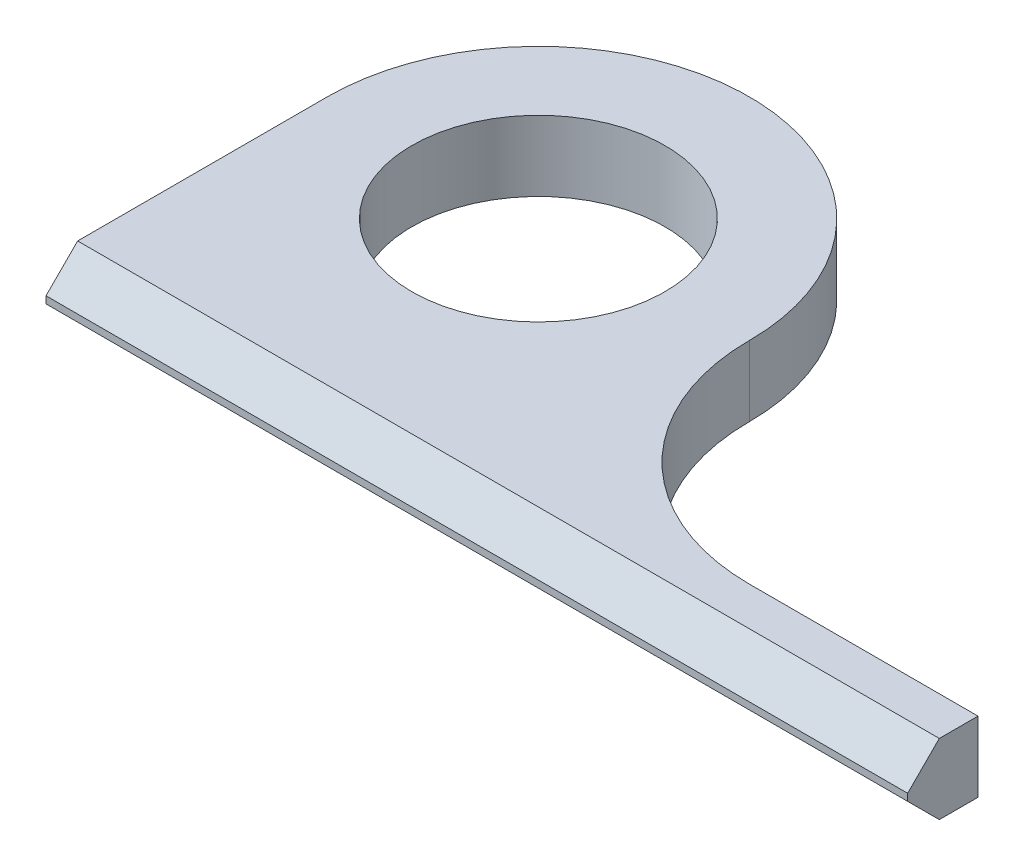
ISO-10303-21;
HEADER;
FILE_DESCRIPTION(('STEP AP214'),'2;1');
FILE_NAME('part.step','',(''),(''),'','','');
FILE_SCHEMA(('AUTOMOTIVE_DESIGN { 1 0 10303 214 1 1 1 1 }'));
ENDSEC;
DATA;
#1=APPLICATION_CONTEXT('core data for automotive mechanical design processes');
#2=APPLICATION_PROTOCOL_DEFINITION('international standard','automotive_design',2000,#1);
#3=PRODUCT_CONTEXT('',#1,'mechanical');
#4=PRODUCT('Part','Part','',(#3));
#5=PRODUCT_RELATED_PRODUCT_CATEGORY('part','',(#4));
#6=PRODUCT_DEFINITION_FORMATION('','',#4);
#7=PRODUCT_DEFINITION_CONTEXT('part definition',#1,'design');
#8=PRODUCT_DEFINITION('design','',#6,#7);
#9=PRODUCT_DEFINITION_SHAPE('','',#8);
#10=(LENGTH_UNIT() NAMED_UNIT(*) SI_UNIT(.MILLI.,.METRE.));
#11=(NAMED_UNIT(*) PLANE_ANGLE_UNIT() SI_UNIT($,.RADIAN.));
#12=(NAMED_UNIT(*) SI_UNIT($,.STERADIAN.) SOLID_ANGLE_UNIT());
#13=UNCERTAINTY_MEASURE_WITH_UNIT(LENGTH_MEASURE(1.E-05),#10,'distance_accuracy_value','');
#14=(GEOMETRIC_REPRESENTATION_CONTEXT(3) GLOBAL_UNCERTAINTY_ASSIGNED_CONTEXT((#13)) GLOBAL_UNIT_ASSIGNED_CONTEXT((#10,
#11,#12)) REPRESENTATION_CONTEXT('',''));
#15=CARTESIAN_POINT('',(0.,0.,0.));
#16=DIRECTION('',(0.,0.,1.));
#17=DIRECTION('',(1.,0.,0.));
#18=AXIS2_PLACEMENT_3D('',#15,#16,#17);
#19=CARTESIAN_POINT('',(62.5,4.5,75.5));
#20=DIRECTION('',(0.,-0.707106781186548,0.707106781186548));
#21=DIRECTION('',(0.,-0.707106781186548,-0.707106781186548));
#22=AXIS2_PLACEMENT_3D('',#19,#20,#21);
#23=PLANE('',#22);
#24=DIRECTION('',(1.,0.,0.));
#25=VECTOR('',#24,1.);
#26=CARTESIAN_POINT('',(-60.0000000000001,9.00000000000001,80.));
#27=LINE('',#26,#25);
#28=CARTESIAN_POINT('',(-60.0000000000001,9.00000000000001,80.));
#29=VERTEX_POINT('',#28);
#30=CARTESIAN_POINT('',(185.,9.00000000000001,80.));
#31=VERTEX_POINT('',#30);
#32=EDGE_CURVE('E144',#29,#31,#27,.T.);
#33=ORIENTED_EDGE('',*,*,#32,.F.);
#34=DIRECTION('',(0.,0.707106781186548,0.707106781186547));
#35=VECTOR('',#34,1.);
#36=CARTESIAN_POINT('',(-60.0000000000001,0.,71.));
#37=LINE('',#36,#35);
#38=CARTESIAN_POINT('',(-60.0000000000001,0.,71.));
#39=VERTEX_POINT('',#38);
#40=EDGE_CURVE('E141',#39,#29,#37,.T.);
#41=ORIENTED_EDGE('',*,*,#40,.F.);
#42=DIRECTION('',(1.,0.,0.));
#43=VECTOR('',#42,1.);
#44=CARTESIAN_POINT('',(0.,0.,71.));
#45=LINE('',#44,#43);
#46=CARTESIAN_POINT('',(185.,0.,71.));
#47=VERTEX_POINT('',#46);
#48=EDGE_CURVE('E132',#39,#47,#45,.T.);
#49=ORIENTED_EDGE('',*,*,#48,.T.);
#50=DIRECTION('',(0.,-0.707106781186548,-0.707106781186547));
#51=VECTOR('',#50,1.);
#52=CARTESIAN_POINT('',(185.,9.00000000000001,80.));
#53=LINE('',#52,#51);
#54=EDGE_CURVE('E131',#31,#47,#53,.T.);
#55=ORIENTED_EDGE('',*,*,#54,.F.);
#56=EDGE_LOOP('',(#33,#41,#49,#55));
#57=FACE_BOUND('',#56,.T.);
#58=ADVANCED_FACE('F23',(#57),#23,.T.);
#59=CARTESIAN_POINT('',(-60.0000000000001,0.,80.));
#60=DIRECTION('',(0.,0.,1.));
#61=DIRECTION('',(1.,0.,0.));
#62=AXIS2_PLACEMENT_3D('',#59,#60,#61);
#63=PLANE('',#62);
#64=DIRECTION('',(0.,1.,0.));
#65=VECTOR('',#64,1.);
#66=CARTESIAN_POINT('',(185.,0.,80.));
#67=LINE('',#66,#65);
#68=CARTESIAN_POINT('',(185.,11.,80.));
#69=VERTEX_POINT('',#68);
#70=EDGE_CURVE('E128',#69,#31,#67,.F.);
#71=ORIENTED_EDGE('',*,*,#70,.F.);
#72=DIRECTION('',(1.,0.,0.));
#73=VECTOR('',#72,1.);
#74=CARTESIAN_POINT('',(62.5,11.,80.));
#75=LINE('',#74,#73);
#76=CARTESIAN_POINT('',(-60.0000000000001,11.,80.));
#77=VERTEX_POINT('',#76);
#78=EDGE_CURVE('E125',#77,#69,#75,.T.);
#79=ORIENTED_EDGE('',*,*,#78,.F.);
#80=DIRECTION('',(0.,1.,0.));
#81=VECTOR('',#80,1.);
#82=CARTESIAN_POINT('',(-60.0000000000001,0.,80.));
#83=LINE('',#82,#81);
#84=EDGE_CURVE('E139',#29,#77,#83,.T.);
#85=ORIENTED_EDGE('',*,*,#84,.F.);
#86=ORIENTED_EDGE('',*,*,#32,.T.);
#87=EDGE_LOOP('',(#71,#79,#85,#86));
#88=FACE_BOUND('',#87,.T.);
#89=ADVANCED_FACE('F231',(#88),#63,.T.);
#90=CARTESIAN_POINT('',(0.,0.,0.));
#91=DIRECTION('',(0.,1.,0.));
#92=DIRECTION('',(0.,0.,1.));
#93=AXIS2_PLACEMENT_3D('',#90,#91,#92);
#94=PLANE('',#93);
#95=CARTESIAN_POINT('',(0.,0.,0.));
#96=DIRECTION('',(0.,1.,0.));
#97=DIRECTION('',(0.,0.,1.));
#98=AXIS2_PLACEMENT_3D('',#95,#96,#97);
#99=CIRCLE('',#98,36.);
#100=CARTESIAN_POINT('',(0.,0.,36.));
#101=VERTEX_POINT('',#100);
#102=EDGE_CURVE('E119',#101,#101,#99,.T.);
#103=ORIENTED_EDGE('',*,*,#102,.T.);
#104=EDGE_LOOP('',(#103));
#105=FACE_BOUND('',#104,.T.);
#106=CARTESIAN_POINT('',(0.,0.,0.));
#107=DIRECTION('',(0.,1.,0.));
#108=DIRECTION('',(0.,0.,1.));
#109=AXIS2_PLACEMENT_3D('',#106,#107,#108);
#110=CIRCLE('',#109,60.);
#111=CARTESIAN_POINT('',(60.,0.,0.));
#112=VERTEX_POINT('',#111);
#113=CARTESIAN_POINT('',(-60.0000000000001,0.,0.));
#114=VERTEX_POINT('',#113);
#115=EDGE_CURVE('E93',#112,#114,#110,.T.);
#116=ORIENTED_EDGE('',*,*,#115,.F.);
#117=CARTESIAN_POINT('',(120.,0.,0.));
#118=DIRECTION('',(0.,1.,0.));
#119=DIRECTION('',(0.,0.,1.));
#120=AXIS2_PLACEMENT_3D('',#117,#118,#119);
#121=CIRCLE('',#120,60.);
#122=CARTESIAN_POINT('',(120.,0.,60.));
#123=VERTEX_POINT('',#122);
#124=EDGE_CURVE('E26',#112,#123,#121,.T.);
#125=ORIENTED_EDGE('',*,*,#124,.T.);
#126=DIRECTION('',(-1.,0.,0.));
#127=VECTOR('',#126,1.);
#128=CARTESIAN_POINT('',(185.,0.,60.));
#129=LINE('',#128,#127);
#130=CARTESIAN_POINT('',(185.,0.,60.));
#131=VERTEX_POINT('',#130);
#132=EDGE_CURVE('E90',#131,#123,#129,.T.);
#133=ORIENTED_EDGE('',*,*,#132,.F.);
#134=DIRECTION('',(0.,0.,-1.));
#135=VECTOR('',#134,1.);
#136=CARTESIAN_POINT('',(185.,0.,80.));
#137=LINE('',#136,#135);
#138=EDGE_CURVE('E112',#47,#131,#137,.T.);
#139=ORIENTED_EDGE('',*,*,#138,.F.);
#140=ORIENTED_EDGE('',*,*,#48,.F.);
#141=DIRECTION('',(0.,0.,1.));
#142=VECTOR('',#141,1.);
#143=CARTESIAN_POINT('',(-60.0000000000001,0.,0.));
#144=LINE('',#143,#142);
#145=EDGE_CURVE('E150',#114,#39,#144,.T.);
#146=ORIENTED_EDGE('',*,*,#145,.F.);
#147=EDGE_LOOP('',(#116,#125,#133,#139,#140,#146));
#148=FACE_BOUND('',#147,.T.);
#149=ADVANCED_FACE('F88',(#105,#148),#94,.F.);
#150=CARTESIAN_POINT('',(185.,0.,80.));
#151=DIRECTION('',(1.,0.,0.));
#152=DIRECTION('',(0.,0.,-1.));
#153=AXIS2_PLACEMENT_3D('',#150,#151,#152);
#154=PLANE('',#153);
#155=DIRECTION('',(0.,0.,1.));
#156=VECTOR('',#155,1.);
#157=CARTESIAN_POINT('',(185.,20.,0.));
#158=LINE('',#157,#156);
#159=CARTESIAN_POINT('',(185.,20.,71.));
#160=VERTEX_POINT('',#159);
#161=CARTESIAN_POINT('',(185.,20.,60.));
#162=VERTEX_POINT('',#161);
#163=EDGE_CURVE('E115',#160,#162,#158,.F.);
#164=ORIENTED_EDGE('',*,*,#163,.F.);
#165=DIRECTION('',(0.,-0.707106781186548,0.707106781186548));
#166=VECTOR('',#165,1.);
#167=CARTESIAN_POINT('',(185.,15.5,75.5));
#168=LINE('',#167,#166);
#169=EDGE_CURVE('E122',#69,#160,#168,.F.);
#170=ORIENTED_EDGE('',*,*,#169,.F.);
#171=ORIENTED_EDGE('',*,*,#70,.T.);
#172=ORIENTED_EDGE('',*,*,#54,.T.);
#173=ORIENTED_EDGE('',*,*,#138,.T.);
#174=DIRECTION('',(0.,1.,0.));
#175=VECTOR('',#174,1.);
#176=CARTESIAN_POINT('',(185.,0.,60.));
#177=LINE('',#176,#175);
#178=EDGE_CURVE('E100',#162,#131,#177,.F.);
#179=ORIENTED_EDGE('',*,*,#178,.F.);
#180=EDGE_LOOP('',(#164,#170,#171,#172,#173,#179));
#181=FACE_BOUND('',#180,.T.);
#182=ADVANCED_FACE('F201',(#181),#154,.T.);
#183=CARTESIAN_POINT('',(185.,0.,60.));
#184=DIRECTION('',(0.,0.,-1.));
#185=DIRECTION('',(-1.,0.,0.));
#186=AXIS2_PLACEMENT_3D('',#183,#184,#185);
#187=PLANE('',#186);
#188=ORIENTED_EDGE('',*,*,#178,.T.);
#189=ORIENTED_EDGE('',*,*,#132,.T.);
#190=DIRECTION('',(0.,1.,0.));
#191=VECTOR('',#190,1.);
#192=CARTESIAN_POINT('',(120.,0.,60.));
#193=LINE('',#192,#191);
#194=CARTESIAN_POINT('',(120.,20.,60.));
#195=VERTEX_POINT('',#194);
#196=EDGE_CURVE('E95',#123,#195,#193,.T.);
#197=ORIENTED_EDGE('',*,*,#196,.T.);
#198=DIRECTION('',(1.,0.,0.));
#199=VECTOR('',#198,1.);
#200=CARTESIAN_POINT('',(0.,20.,60.));
#201=LINE('',#200,#199);
#202=EDGE_CURVE('E118',#162,#195,#201,.F.);
#203=ORIENTED_EDGE('',*,*,#202,.F.);
#204=EDGE_LOOP('',(#188,#189,#197,#203));
#205=FACE_BOUND('',#204,.T.);
#206=ADVANCED_FACE('F97',(#205),#187,.T.);
#207=CARTESIAN_POINT('',(120.,0.,0.));
#208=DIRECTION('',(0.,1.,0.));
#209=DIRECTION('',(0.,0.,1.));
#210=AXIS2_PLACEMENT_3D('',#207,#208,#209);
#211=CYLINDRICAL_SURFACE('',#210,60.);
#212=CARTESIAN_POINT('',(120.,20.,0.));
#213=DIRECTION('',(0.,1.,0.));
#214=DIRECTION('',(0.,0.,1.));
#215=AXIS2_PLACEMENT_3D('',#212,#213,#214);
#216=CIRCLE('',#215,60.);
#217=CARTESIAN_POINT('',(60.,20.,0.));
#218=VERTEX_POINT('',#217);
#219=EDGE_CURVE('E104',#195,#218,#216,.F.);
#220=ORIENTED_EDGE('',*,*,#219,.F.);
#221=ORIENTED_EDGE('',*,*,#196,.F.);
#222=ORIENTED_EDGE('',*,*,#124,.F.);
#223=DIRECTION('',(0.,1.,0.));
#224=VECTOR('',#223,1.);
#225=CARTESIAN_POINT('',(60.,0.,-1.38777878078145E-13));
#226=LINE('',#225,#224);
#227=EDGE_CURVE('E106',#218,#112,#226,.F.);
#228=ORIENTED_EDGE('',*,*,#227,.F.);
#229=EDGE_LOOP('',(#220,#221,#222,#228));
#230=FACE_BOUND('',#229,.T.);
#231=ADVANCED_FACE('F102',(#230),#211,.F.);
#232=CARTESIAN_POINT('',(0.,0.,0.));
#233=DIRECTION('',(0.,1.,0.));
#234=DIRECTION('',(0.,0.,1.));
#235=AXIS2_PLACEMENT_3D('',#232,#233,#234);
#236=CYLINDRICAL_SURFACE('',#235,60.);
#237=ORIENTED_EDGE('',*,*,#227,.T.);
#238=ORIENTED_EDGE('',*,*,#115,.T.);
#239=DIRECTION('',(0.,1.,0.));
#240=VECTOR('',#239,1.);
#241=CARTESIAN_POINT('',(-60.0000000000001,0.,0.));
#242=LINE('',#241,#240);
#243=CARTESIAN_POINT('',(-60.0000000000001,20.,0.));
#244=VERTEX_POINT('',#243);
#245=EDGE_CURVE('E155',#244,#114,#242,.F.);
#246=ORIENTED_EDGE('',*,*,#245,.F.);
#247=CARTESIAN_POINT('',(0.,20.,0.));
#248=DIRECTION('',(0.,1.,0.));
#249=DIRECTION('',(0.,0.,1.));
#250=AXIS2_PLACEMENT_3D('',#247,#248,#249);
#251=CIRCLE('',#250,60.);
#252=EDGE_CURVE('E170',#218,#244,#251,.T.);
#253=ORIENTED_EDGE('',*,*,#252,.F.);
#254=EDGE_LOOP('',(#237,#238,#246,#253));
#255=FACE_BOUND('',#254,.T.);
#256=ADVANCED_FACE('F208',(#255),#236,.T.);
#257=CARTESIAN_POINT('',(-60.0000000000001,0.,0.));
#258=DIRECTION('',(-1.,0.,0.));
#259=DIRECTION('',(0.,0.,1.));
#260=AXIS2_PLACEMENT_3D('',#257,#258,#259);
#261=PLANE('',#260);
#262=ORIENTED_EDGE('',*,*,#84,.T.);
#263=DIRECTION('',(0.,-0.707106781186548,0.707106781186548));
#264=VECTOR('',#263,1.);
#265=CARTESIAN_POINT('',(-60.0000000000001,15.5,75.5));
#266=LINE('',#265,#264);
#267=CARTESIAN_POINT('',(-60.0000000000001,20.,71.));
#268=VERTEX_POINT('',#267);
#269=EDGE_CURVE('E41',#268,#77,#266,.T.);
#270=ORIENTED_EDGE('',*,*,#269,.F.);
#271=DIRECTION('',(0.,0.,1.));
#272=VECTOR('',#271,1.);
#273=CARTESIAN_POINT('',(-60.0000000000001,20.,0.));
#274=LINE('',#273,#272);
#275=EDGE_CURVE('E173',#244,#268,#274,.T.);
#276=ORIENTED_EDGE('',*,*,#275,.F.);
#277=ORIENTED_EDGE('',*,*,#245,.T.);
#278=ORIENTED_EDGE('',*,*,#145,.T.);
#279=ORIENTED_EDGE('',*,*,#40,.T.);
#280=EDGE_LOOP('',(#262,#270,#276,#277,#278,#279));
#281=FACE_BOUND('',#280,.T.);
#282=ADVANCED_FACE('F206',(#281),#261,.T.);
#283=CARTESIAN_POINT('',(62.5,15.5,75.5));
#284=DIRECTION('',(0.,0.707106781186548,0.707106781186548));
#285=DIRECTION('',(0.,-0.707106781186548,0.707106781186548));
#286=AXIS2_PLACEMENT_3D('',#283,#284,#285);
#287=PLANE('',#286);
#288=ORIENTED_EDGE('',*,*,#78,.T.);
#289=ORIENTED_EDGE('',*,*,#169,.T.);
#290=DIRECTION('',(1.,0.,0.));
#291=VECTOR('',#290,1.);
#292=CARTESIAN_POINT('',(0.,20.,71.));
#293=LINE('',#292,#291);
#294=EDGE_CURVE('E32',#268,#160,#293,.T.);
#295=ORIENTED_EDGE('',*,*,#294,.F.);
#296=ORIENTED_EDGE('',*,*,#269,.T.);
#297=EDGE_LOOP('',(#288,#289,#295,#296));
#298=FACE_BOUND('',#297,.T.);
#299=ADVANCED_FACE('F189',(#298),#287,.T.);
#300=CARTESIAN_POINT('',(0.,0.,0.));
#301=DIRECTION('',(0.,1.,0.));
#302=DIRECTION('',(0.,0.,1.));
#303=AXIS2_PLACEMENT_3D('',#300,#301,#302);
#304=CYLINDRICAL_SURFACE('',#303,36.);
#305=CARTESIAN_POINT('',(0.,20.,0.));
#306=DIRECTION('',(0.,1.,0.));
#307=DIRECTION('',(0.,0.,1.));
#308=AXIS2_PLACEMENT_3D('',#305,#306,#307);
#309=CIRCLE('',#308,36.);
#310=CARTESIAN_POINT('',(0.,20.,36.));
#311=VERTEX_POINT('',#310);
#312=EDGE_CURVE('E13',#311,#311,#309,.F.);
#313=ORIENTED_EDGE('',*,*,#312,.F.);
#314=EDGE_LOOP('',(#313));
#315=FACE_BOUND('',#314,.T.);
#316=ORIENTED_EDGE('',*,*,#102,.F.);
#317=EDGE_LOOP('',(#316));
#318=FACE_BOUND('',#317,.T.);
#319=ADVANCED_FACE('F215',(#315,#318),#304,.F.);
#320=CARTESIAN_POINT('',(0.,20.,0.));
#321=DIRECTION('',(0.,1.,0.));
#322=DIRECTION('',(0.,0.,1.));
#323=AXIS2_PLACEMENT_3D('',#320,#321,#322);
#324=PLANE('',#323);
#325=ORIENTED_EDGE('',*,*,#312,.T.);
#326=EDGE_LOOP('',(#325));
#327=FACE_BOUND('',#326,.T.);
#328=ORIENTED_EDGE('',*,*,#275,.T.);
#329=ORIENTED_EDGE('',*,*,#294,.T.);
#330=ORIENTED_EDGE('',*,*,#163,.T.);
#331=ORIENTED_EDGE('',*,*,#202,.T.);
#332=ORIENTED_EDGE('',*,*,#219,.T.);
#333=ORIENTED_EDGE('',*,*,#252,.T.);
#334=EDGE_LOOP('',(#328,#329,#330,#331,#332,#333));
#335=FACE_BOUND('',#334,.T.);
#336=ADVANCED_FACE('F194',(#327,#335),#324,.T.);
#337=CLOSED_SHELL('',(#58,#89,#149,#182,#206,#231,#256,#282,#299,#319,#336));
#338=MANIFOLD_SOLID_BREP('B1',#337);
#339=ADVANCED_BREP_SHAPE_REPRESENTATION('',(#18,#338),#14);
#340=SHAPE_DEFINITION_REPRESENTATION(#9,#339);
ENDSEC;
END-ISO-10303-21;
